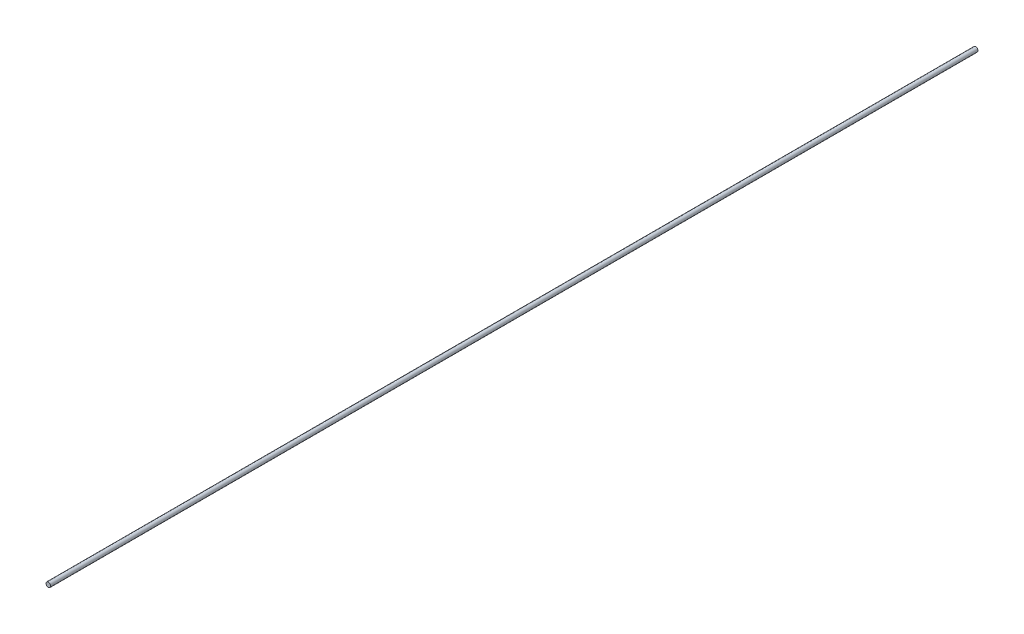
ISO-10303-21;
HEADER;
FILE_DESCRIPTION(('STEP AP214'),'2;1');
FILE_NAME('part.step','',(''),(''),'','','');
FILE_SCHEMA(('AUTOMOTIVE_DESIGN { 1 0 10303 214 1 1 1 1 }'));
ENDSEC;
DATA;
#1=APPLICATION_CONTEXT('core data for automotive mechanical design processes');
#2=APPLICATION_PROTOCOL_DEFINITION('international standard','automotive_design',2000,#1);
#3=PRODUCT_CONTEXT('',#1,'mechanical');
#4=PRODUCT('Part','Part','',(#3));
#5=PRODUCT_RELATED_PRODUCT_CATEGORY('part','',(#4));
#6=PRODUCT_DEFINITION_FORMATION('','',#4);
#7=PRODUCT_DEFINITION_CONTEXT('part definition',#1,'design');
#8=PRODUCT_DEFINITION('design','',#6,#7);
#9=PRODUCT_DEFINITION_SHAPE('','',#8);
#10=(LENGTH_UNIT() NAMED_UNIT(*) SI_UNIT(.MILLI.,.METRE.));
#11=(NAMED_UNIT(*) PLANE_ANGLE_UNIT() SI_UNIT($,.RADIAN.));
#12=(NAMED_UNIT(*) SI_UNIT($,.STERADIAN.) SOLID_ANGLE_UNIT());
#13=UNCERTAINTY_MEASURE_WITH_UNIT(LENGTH_MEASURE(1.E-05),#10,'distance_accuracy_value','');
#14=(GEOMETRIC_REPRESENTATION_CONTEXT(3) GLOBAL_UNCERTAINTY_ASSIGNED_CONTEXT((#13)) GLOBAL_UNIT_ASSIGNED_CONTEXT((#10,
#11,#12)) REPRESENTATION_CONTEXT('',''));
#15=CARTESIAN_POINT('',(0.,0.,0.));
#16=DIRECTION('',(0.,0.,1.));
#17=DIRECTION('',(1.,0.,0.));
#18=AXIS2_PLACEMENT_3D('',#15,#16,#17);
#19=CARTESIAN_POINT('',(2.22044604925031E-13,3.5527136788005E-12,1016.));
#20=DIRECTION('',(0.,0.,-0.999999999999998));
#21=DIRECTION('',(-1.,0.,0.));
#22=AXIS2_PLACEMENT_3D('',#19,#20,#21);
#23=CYLINDRICAL_SURFACE('',#22,2.54);
#24=CARTESIAN_POINT('',(2.22044604925031E-13,3.5527136788005E-12,1016.));
#25=DIRECTION('',(0.,0.,0.999999999999998));
#26=DIRECTION('',(1.,0.,0.));
#27=AXIS2_PLACEMENT_3D('',#24,#25,#26);
#28=CIRCLE('',#27,2.54);
#29=CARTESIAN_POINT('',(2.54000000000022,3.55243168215225E-12,1016.));
#30=VERTEX_POINT('',#29);
#31=EDGE_CURVE('E10',#30,#30,#28,.T.);
#32=ORIENTED_EDGE('',*,*,#31,.F.);
#33=EDGE_LOOP('',(#32));
#34=FACE_BOUND('',#33,.T.);
#35=CARTESIAN_POINT('',(1.11022302462516E-13,0.,0.));
#36=DIRECTION('',(0.,0.,0.999999999999998));
#37=DIRECTION('',(1.,0.,0.));
#38=AXIS2_PLACEMENT_3D('',#35,#36,#37);
#39=CIRCLE('',#38,2.54);
#40=CARTESIAN_POINT('',(2.54000000000011,0.,0.));
#41=VERTEX_POINT('',#40);
#42=EDGE_CURVE('E39',#41,#41,#39,.T.);
#43=ORIENTED_EDGE('',*,*,#42,.T.);
#44=EDGE_LOOP('',(#43));
#45=FACE_BOUND('',#44,.T.);
#46=ADVANCED_FACE('F36',(#34,#45),#23,.T.);
#47=CARTESIAN_POINT('',(2.22044604925031E-13,3.5527136788005E-12,1016.));
#48=DIRECTION('',(0.,0.,0.999999999999998));
#49=DIRECTION('',(1.,0.,0.));
#50=AXIS2_PLACEMENT_3D('',#47,#48,#49);
#51=PLANE('',#50);
#52=ORIENTED_EDGE('',*,*,#31,.T.);
#53=EDGE_LOOP('',(#52));
#54=FACE_BOUND('',#53,.T.);
#55=ADVANCED_FACE('F53',(#54),#51,.T.);
#56=CARTESIAN_POINT('',(1.11022302462516E-13,0.,0.));
#57=DIRECTION('',(0.,0.,0.999999999999998));
#58=DIRECTION('',(1.,0.,0.));
#59=AXIS2_PLACEMENT_3D('',#56,#57,#58);
#60=PLANE('',#59);
#61=ORIENTED_EDGE('',*,*,#42,.F.);
#62=EDGE_LOOP('',(#61));
#63=FACE_BOUND('',#62,.T.);
#64=ADVANCED_FACE('F51',(#63),#60,.F.);
#65=CLOSED_SHELL('',(#46,#55,#64));
#66=MANIFOLD_SOLID_BREP('B2',#65);
#67=ADVANCED_BREP_SHAPE_REPRESENTATION('',(#18,#66),#14);
#68=SHAPE_DEFINITION_REPRESENTATION(#9,#67);
ENDSEC;
END-ISO-10303-21;
